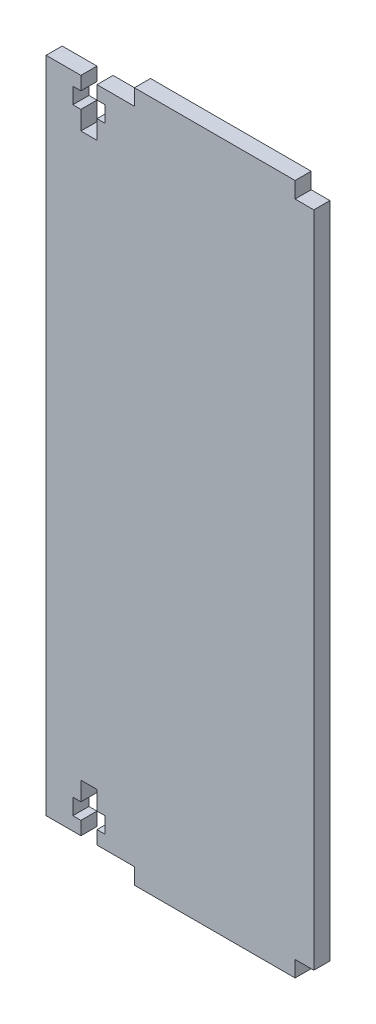
ISO-10303-21;
HEADER;
FILE_DESCRIPTION(('STEP AP214'),'2;1');
FILE_NAME('part.step','',(''),(''),'','','');
FILE_SCHEMA(('AUTOMOTIVE_DESIGN { 1 0 10303 214 1 1 1 1 }'));
ENDSEC;
DATA;
#1=APPLICATION_CONTEXT('core data for automotive mechanical design processes');
#2=APPLICATION_PROTOCOL_DEFINITION('international standard','automotive_design',2000,#1);
#3=PRODUCT_CONTEXT('',#1,'mechanical');
#4=PRODUCT('Part','Part','',(#3));
#5=PRODUCT_RELATED_PRODUCT_CATEGORY('part','',(#4));
#6=PRODUCT_DEFINITION_FORMATION('','',#4);
#7=PRODUCT_DEFINITION_CONTEXT('part definition',#1,'design');
#8=PRODUCT_DEFINITION('design','',#6,#7);
#9=PRODUCT_DEFINITION_SHAPE('','',#8);
#10=(LENGTH_UNIT() NAMED_UNIT(*) SI_UNIT(.MILLI.,.METRE.));
#11=(NAMED_UNIT(*) PLANE_ANGLE_UNIT() SI_UNIT($,.RADIAN.));
#12=(NAMED_UNIT(*) SI_UNIT($,.STERADIAN.) SOLID_ANGLE_UNIT());
#13=UNCERTAINTY_MEASURE_WITH_UNIT(LENGTH_MEASURE(1.E-05),#10,'distance_accuracy_value','');
#14=(GEOMETRIC_REPRESENTATION_CONTEXT(3) GLOBAL_UNCERTAINTY_ASSIGNED_CONTEXT((#13)) GLOBAL_UNIT_ASSIGNED_CONTEXT((#10,
#11,#12)) REPRESENTATION_CONTEXT('',''));
#15=CARTESIAN_POINT('',(0.,0.,0.));
#16=DIRECTION('',(0.,0.,1.));
#17=DIRECTION('',(1.,0.,0.));
#18=AXIS2_PLACEMENT_3D('',#15,#16,#17);
#19=CARTESIAN_POINT('',(21.5,-61.5,3.));
#20=DIRECTION('',(0.,1.,0.));
#21=DIRECTION('',(-1.,0.,0.));
#22=AXIS2_PLACEMENT_3D('',#19,#20,#21);
#23=PLANE('',#22);
#24=DIRECTION('',(1.,0.,0.));
#25=VECTOR('',#24,1.);
#26=CARTESIAN_POINT('',(21.5,-61.5,0.));
#27=LINE('',#26,#25);
#28=CARTESIAN_POINT('',(21.5,-61.5,0.));
#29=VERTEX_POINT('',#28);
#30=CARTESIAN_POINT('',(25.,-61.5,0.));
#31=VERTEX_POINT('',#30);
#32=EDGE_CURVE('E297',#29,#31,#27,.T.);
#33=ORIENTED_EDGE('',*,*,#32,.T.);
#34=DIRECTION('',(0.,0.,-1.));
#35=VECTOR('',#34,1.);
#36=CARTESIAN_POINT('',(25.,-61.5,3.));
#37=LINE('',#36,#35);
#38=CARTESIAN_POINT('',(25.,-61.5,3.));
#39=VERTEX_POINT('',#38);
#40=EDGE_CURVE('E11',#39,#31,#37,.T.);
#41=ORIENTED_EDGE('',*,*,#40,.F.);
#42=DIRECTION('',(1.,0.,0.));
#43=VECTOR('',#42,1.);
#44=CARTESIAN_POINT('',(21.5,-61.5,3.));
#45=LINE('',#44,#43);
#46=CARTESIAN_POINT('',(21.5,-61.5,3.));
#47=VERTEX_POINT('',#46);
#48=EDGE_CURVE('E367',#47,#39,#45,.T.);
#49=ORIENTED_EDGE('',*,*,#48,.F.);
#50=DIRECTION('',(0.,0.,-1.));
#51=VECTOR('',#50,1.);
#52=CARTESIAN_POINT('',(21.5,-61.5,3.));
#53=LINE('',#52,#51);
#54=EDGE_CURVE('E293',#47,#29,#53,.T.);
#55=ORIENTED_EDGE('',*,*,#54,.T.);
#56=EDGE_LOOP('',(#33,#41,#49,#55));
#57=FACE_BOUND('',#56,.T.);
#58=ADVANCED_FACE('F33',(#57),#23,.F.);
#59=CARTESIAN_POINT('',(25.,61.5,3.));
#60=DIRECTION('',(-1.,0.,0.));
#61=DIRECTION('',(0.,-1.,0.));
#62=AXIS2_PLACEMENT_3D('',#59,#60,#61);
#63=PLANE('',#62);
#64=DIRECTION('',(0.,1.,0.));
#65=VECTOR('',#64,1.);
#66=CARTESIAN_POINT('',(25.,61.5,0.));
#67=LINE('',#66,#65);
#68=CARTESIAN_POINT('',(25.,61.5,0.));
#69=VERTEX_POINT('',#68);
#70=EDGE_CURVE('E300',#31,#69,#67,.T.);
#71=ORIENTED_EDGE('',*,*,#70,.T.);
#72=DIRECTION('',(0.,0.,-1.));
#73=VECTOR('',#72,1.);
#74=CARTESIAN_POINT('',(25.,61.5,3.));
#75=LINE('',#74,#73);
#76=CARTESIAN_POINT('',(25.,61.5,3.));
#77=VERTEX_POINT('',#76);
#78=EDGE_CURVE('E41',#77,#69,#75,.T.);
#79=ORIENTED_EDGE('',*,*,#78,.F.);
#80=DIRECTION('',(0.,1.,0.));
#81=VECTOR('',#80,1.);
#82=CARTESIAN_POINT('',(25.,61.5,3.));
#83=LINE('',#82,#81);
#84=EDGE_CURVE('E176',#39,#77,#83,.T.);
#85=ORIENTED_EDGE('',*,*,#84,.F.);
#86=ORIENTED_EDGE('',*,*,#40,.T.);
#87=EDGE_LOOP('',(#71,#79,#85,#86));
#88=FACE_BOUND('',#87,.T.);
#89=ADVANCED_FACE('F565',(#88),#63,.F.);
#90=CARTESIAN_POINT('',(21.5,61.5,3.));
#91=DIRECTION('',(0.,-1.,0.));
#92=DIRECTION('',(1.,0.,0.));
#93=AXIS2_PLACEMENT_3D('',#90,#91,#92);
#94=PLANE('',#93);
#95=DIRECTION('',(-1.,0.,0.));
#96=VECTOR('',#95,1.);
#97=CARTESIAN_POINT('',(21.5,61.5,0.));
#98=LINE('',#97,#96);
#99=CARTESIAN_POINT('',(21.5,61.5,0.));
#100=VERTEX_POINT('',#99);
#101=EDGE_CURVE('E302',#69,#100,#98,.T.);
#102=ORIENTED_EDGE('',*,*,#101,.T.);
#103=DIRECTION('',(0.,0.,-1.));
#104=VECTOR('',#103,1.);
#105=CARTESIAN_POINT('',(21.5,61.5,3.));
#106=LINE('',#105,#104);
#107=CARTESIAN_POINT('',(21.5,61.5,3.));
#108=VERTEX_POINT('',#107);
#109=EDGE_CURVE('E458',#108,#100,#106,.T.);
#110=ORIENTED_EDGE('',*,*,#109,.F.);
#111=DIRECTION('',(-1.,0.,0.));
#112=VECTOR('',#111,1.);
#113=CARTESIAN_POINT('',(21.5,61.5,3.));
#114=LINE('',#113,#112);
#115=EDGE_CURVE('E466',#77,#108,#114,.T.);
#116=ORIENTED_EDGE('',*,*,#115,.F.);
#117=ORIENTED_EDGE('',*,*,#78,.T.);
#118=EDGE_LOOP('',(#102,#110,#116,#117));
#119=FACE_BOUND('',#118,.T.);
#120=ADVANCED_FACE('F464',(#119),#94,.F.);
#121=CARTESIAN_POINT('',(21.5,64.5,3.));
#122=DIRECTION('',(-1.,0.,0.));
#123=DIRECTION('',(0.,0.,1.));
#124=AXIS2_PLACEMENT_3D('',#121,#122,#123);
#125=PLANE('',#124);
#126=DIRECTION('',(0.,1.,0.));
#127=VECTOR('',#126,1.);
#128=CARTESIAN_POINT('',(21.5,64.5,0.));
#129=LINE('',#128,#127);
#130=CARTESIAN_POINT('',(21.5,64.5,0.));
#131=VERTEX_POINT('',#130);
#132=EDGE_CURVE('E304',#100,#131,#129,.T.);
#133=ORIENTED_EDGE('',*,*,#132,.T.);
#134=DIRECTION('',(0.,0.,-1.));
#135=VECTOR('',#134,1.);
#136=CARTESIAN_POINT('',(21.5,64.5,3.));
#137=LINE('',#136,#135);
#138=CARTESIAN_POINT('',(21.5,64.5,3.));
#139=VERTEX_POINT('',#138);
#140=EDGE_CURVE('E455',#139,#131,#137,.T.);
#141=ORIENTED_EDGE('',*,*,#140,.F.);
#142=DIRECTION('',(0.,1.,0.));
#143=VECTOR('',#142,1.);
#144=CARTESIAN_POINT('',(21.5,64.5,3.));
#145=LINE('',#144,#143);
#146=EDGE_CURVE('E484',#108,#139,#145,.T.);
#147=ORIENTED_EDGE('',*,*,#146,.F.);
#148=ORIENTED_EDGE('',*,*,#109,.T.);
#149=EDGE_LOOP('',(#133,#141,#147,#148));
#150=FACE_BOUND('',#149,.T.);
#151=ADVANCED_FACE('F475',(#150),#125,.F.);
#152=CARTESIAN_POINT('',(-8.50000000000002,64.5,3.));
#153=DIRECTION('',(0.,-1.,0.));
#154=DIRECTION('',(0.,0.,-1.));
#155=AXIS2_PLACEMENT_3D('',#152,#153,#154);
#156=PLANE('',#155);
#157=DIRECTION('',(-1.,0.,0.));
#158=VECTOR('',#157,1.);
#159=CARTESIAN_POINT('',(-8.50000000000002,64.5,0.));
#160=LINE('',#159,#158);
#161=CARTESIAN_POINT('',(-8.50000000000002,64.5,0.));
#162=VERTEX_POINT('',#161);
#163=EDGE_CURVE('E306',#131,#162,#160,.T.);
#164=ORIENTED_EDGE('',*,*,#163,.T.);
#165=DIRECTION('',(0.,0.,-1.));
#166=VECTOR('',#165,1.);
#167=CARTESIAN_POINT('',(-8.50000000000002,64.5,3.));
#168=LINE('',#167,#166);
#169=CARTESIAN_POINT('',(-8.50000000000002,64.5,3.));
#170=VERTEX_POINT('',#169);
#171=EDGE_CURVE('E452',#170,#162,#168,.T.);
#172=ORIENTED_EDGE('',*,*,#171,.F.);
#173=DIRECTION('',(-1.,0.,0.));
#174=VECTOR('',#173,1.);
#175=CARTESIAN_POINT('',(-8.50000000000002,64.5,3.));
#176=LINE('',#175,#174);
#177=EDGE_CURVE('E481',#139,#170,#176,.T.);
#178=ORIENTED_EDGE('',*,*,#177,.F.);
#179=ORIENTED_EDGE('',*,*,#140,.T.);
#180=EDGE_LOOP('',(#164,#172,#178,#179));
#181=FACE_BOUND('',#180,.T.);
#182=ADVANCED_FACE('F479',(#181),#156,.F.);
#183=CARTESIAN_POINT('',(-8.50000000000002,64.5,3.));
#184=DIRECTION('',(1.,0.,0.));
#185=DIRECTION('',(0.,0.,-1.));
#186=AXIS2_PLACEMENT_3D('',#183,#184,#185);
#187=PLANE('',#186);
#188=DIRECTION('',(0.,-1.,0.));
#189=VECTOR('',#188,1.);
#190=CARTESIAN_POINT('',(-8.50000000000002,64.5,0.));
#191=LINE('',#190,#189);
#192=CARTESIAN_POINT('',(-8.50000000000002,61.5,0.));
#193=VERTEX_POINT('',#192);
#194=EDGE_CURVE('E308',#162,#193,#191,.T.);
#195=ORIENTED_EDGE('',*,*,#194,.T.);
#196=DIRECTION('',(0.,0.,-1.));
#197=VECTOR('',#196,1.);
#198=CARTESIAN_POINT('',(-8.50000000000002,61.5,3.));
#199=LINE('',#198,#197);
#200=CARTESIAN_POINT('',(-8.50000000000002,61.5,3.));
#201=VERTEX_POINT('',#200);
#202=EDGE_CURVE('E449',#201,#193,#199,.T.);
#203=ORIENTED_EDGE('',*,*,#202,.F.);
#204=DIRECTION('',(0.,-1.,0.));
#205=VECTOR('',#204,1.);
#206=CARTESIAN_POINT('',(-8.50000000000002,64.5,3.));
#207=LINE('',#206,#205);
#208=EDGE_CURVE('E483',#170,#201,#207,.T.);
#209=ORIENTED_EDGE('',*,*,#208,.F.);
#210=ORIENTED_EDGE('',*,*,#171,.T.);
#211=EDGE_LOOP('',(#195,#203,#209,#210));
#212=FACE_BOUND('',#211,.T.);
#213=ADVANCED_FACE('F578',(#212),#187,.F.);
#214=CARTESIAN_POINT('',(-15.5000000000002,61.5,3.));
#215=DIRECTION('',(0.,-1.,0.));
#216=DIRECTION('',(1.,0.,0.));
#217=AXIS2_PLACEMENT_3D('',#214,#215,#216);
#218=PLANE('',#217);
#219=DIRECTION('',(-1.,0.,0.));
#220=VECTOR('',#219,1.);
#221=CARTESIAN_POINT('',(-15.5000000000002,61.5,0.));
#222=LINE('',#221,#220);
#223=CARTESIAN_POINT('',(-15.5000000000002,61.5,0.));
#224=VERTEX_POINT('',#223);
#225=EDGE_CURVE('E310',#193,#224,#222,.T.);
#226=ORIENTED_EDGE('',*,*,#225,.T.);
#227=DIRECTION('',(0.,0.,-1.));
#228=VECTOR('',#227,1.);
#229=CARTESIAN_POINT('',(-15.5000000000002,61.5,3.));
#230=LINE('',#229,#228);
#231=CARTESIAN_POINT('',(-15.5000000000002,61.5,3.));
#232=VERTEX_POINT('',#231);
#233=EDGE_CURVE('E446',#232,#224,#230,.T.);
#234=ORIENTED_EDGE('',*,*,#233,.F.);
#235=DIRECTION('',(-1.,0.,0.));
#236=VECTOR('',#235,1.);
#237=CARTESIAN_POINT('',(-15.5000000000002,61.5,3.));
#238=LINE('',#237,#236);
#239=EDGE_CURVE('E486',#201,#232,#238,.T.);
#240=ORIENTED_EDGE('',*,*,#239,.F.);
#241=ORIENTED_EDGE('',*,*,#202,.T.);
#242=EDGE_LOOP('',(#226,#234,#240,#241));
#243=FACE_BOUND('',#242,.T.);
#244=ADVANCED_FACE('F581',(#243),#218,.F.);
#245=CARTESIAN_POINT('',(-15.5000000000002,59.,3.));
#246=DIRECTION('',(1.,0.,0.));
#247=DIRECTION('',(0.,1.,0.));
#248=AXIS2_PLACEMENT_3D('',#245,#246,#247);
#249=PLANE('',#248);
#250=DIRECTION('',(0.,-1.,0.));
#251=VECTOR('',#250,1.);
#252=CARTESIAN_POINT('',(-15.5000000000002,59.,0.));
#253=LINE('',#252,#251);
#254=CARTESIAN_POINT('',(-15.5000000000002,59.,0.));
#255=VERTEX_POINT('',#254);
#256=EDGE_CURVE('E312',#224,#255,#253,.T.);
#257=ORIENTED_EDGE('',*,*,#256,.T.);
#258=DIRECTION('',(0.,0.,-1.));
#259=VECTOR('',#258,1.);
#260=CARTESIAN_POINT('',(-15.5000000000002,59.,3.));
#261=LINE('',#260,#259);
#262=CARTESIAN_POINT('',(-15.5000000000002,59.,3.));
#263=VERTEX_POINT('',#262);
#264=EDGE_CURVE('E443',#263,#255,#261,.T.);
#265=ORIENTED_EDGE('',*,*,#264,.F.);
#266=DIRECTION('',(0.,-1.,0.));
#267=VECTOR('',#266,1.);
#268=CARTESIAN_POINT('',(-15.5000000000002,59.,3.));
#269=LINE('',#268,#267);
#270=EDGE_CURVE('E492',#232,#263,#269,.T.);
#271=ORIENTED_EDGE('',*,*,#270,.F.);
#272=ORIENTED_EDGE('',*,*,#233,.T.);
#273=EDGE_LOOP('',(#257,#265,#271,#272));
#274=FACE_BOUND('',#273,.T.);
#275=ADVANCED_FACE('F585',(#274),#249,.F.);
#276=CARTESIAN_POINT('',(-15.5000000000002,59.,3.));
#277=DIRECTION('',(0.,1.,0.));
#278=DIRECTION('',(0.,0.,1.));
#279=AXIS2_PLACEMENT_3D('',#276,#277,#278);
#280=PLANE('',#279);
#281=DIRECTION('',(1.,0.,0.));
#282=VECTOR('',#281,1.);
#283=CARTESIAN_POINT('',(-15.5000000000002,59.,0.));
#284=LINE('',#283,#282);
#285=CARTESIAN_POINT('',(-14.0000000000002,59.,0.));
#286=VERTEX_POINT('',#285);
#287=EDGE_CURVE('E314',#255,#286,#284,.T.);
#288=ORIENTED_EDGE('',*,*,#287,.T.);
#289=DIRECTION('',(0.,0.,-1.));
#290=VECTOR('',#289,1.);
#291=CARTESIAN_POINT('',(-14.0000000000002,59.,3.));
#292=LINE('',#291,#290);
#293=CARTESIAN_POINT('',(-14.0000000000002,59.,3.));
#294=VERTEX_POINT('',#293);
#295=EDGE_CURVE('E440',#294,#286,#292,.T.);
#296=ORIENTED_EDGE('',*,*,#295,.F.);
#297=DIRECTION('',(1.,0.,0.));
#298=VECTOR('',#297,1.);
#299=CARTESIAN_POINT('',(-15.5000000000002,59.,3.));
#300=LINE('',#299,#298);
#301=EDGE_CURVE('E494',#263,#294,#300,.T.);
#302=ORIENTED_EDGE('',*,*,#301,.F.);
#303=ORIENTED_EDGE('',*,*,#264,.T.);
#304=EDGE_LOOP('',(#288,#296,#302,#303));
#305=FACE_BOUND('',#304,.T.);
#306=ADVANCED_FACE('F589',(#305),#280,.F.);
#307=CARTESIAN_POINT('',(-14.0000000000002,59.,3.));
#308=DIRECTION('',(1.,0.,0.));
#309=DIRECTION('',(0.,1.,0.));
#310=AXIS2_PLACEMENT_3D('',#307,#308,#309);
#311=PLANE('',#310);
#312=DIRECTION('',(0.,-1.,0.));
#313=VECTOR('',#312,1.);
#314=CARTESIAN_POINT('',(-14.0000000000002,59.,0.));
#315=LINE('',#314,#313);
#316=CARTESIAN_POINT('',(-14.0000000000002,56.,0.));
#317=VERTEX_POINT('',#316);
#318=EDGE_CURVE('E316',#286,#317,#315,.T.);
#319=ORIENTED_EDGE('',*,*,#318,.T.);
#320=DIRECTION('',(0.,0.,-1.));
#321=VECTOR('',#320,1.);
#322=CARTESIAN_POINT('',(-14.0000000000002,56.,3.));
#323=LINE('',#322,#321);
#324=CARTESIAN_POINT('',(-14.0000000000002,56.,3.));
#325=VERTEX_POINT('',#324);
#326=EDGE_CURVE('E437',#325,#317,#323,.T.);
#327=ORIENTED_EDGE('',*,*,#326,.F.);
#328=DIRECTION('',(0.,-1.,0.));
#329=VECTOR('',#328,1.);
#330=CARTESIAN_POINT('',(-14.0000000000002,59.,3.));
#331=LINE('',#330,#329);
#332=EDGE_CURVE('E496',#294,#325,#331,.T.);
#333=ORIENTED_EDGE('',*,*,#332,.F.);
#334=ORIENTED_EDGE('',*,*,#295,.T.);
#335=EDGE_LOOP('',(#319,#327,#333,#334));
#336=FACE_BOUND('',#335,.T.);
#337=ADVANCED_FACE('F593',(#336),#311,.F.);
#338=CARTESIAN_POINT('',(-15.5000000000002,56.,3.));
#339=DIRECTION('',(0.,-1.,0.));
#340=DIRECTION('',(1.,0.,0.));
#341=AXIS2_PLACEMENT_3D('',#338,#339,#340);
#342=PLANE('',#341);
#343=DIRECTION('',(-1.,0.,0.));
#344=VECTOR('',#343,1.);
#345=CARTESIAN_POINT('',(-15.5000000000002,56.,0.));
#346=LINE('',#345,#344);
#347=CARTESIAN_POINT('',(-15.5000000000002,56.,0.));
#348=VERTEX_POINT('',#347);
#349=EDGE_CURVE('E318',#317,#348,#346,.T.);
#350=ORIENTED_EDGE('',*,*,#349,.T.);
#351=DIRECTION('',(0.,0.,-1.));
#352=VECTOR('',#351,1.);
#353=CARTESIAN_POINT('',(-15.5000000000002,56.,3.));
#354=LINE('',#353,#352);
#355=CARTESIAN_POINT('',(-15.5000000000002,56.,3.));
#356=VERTEX_POINT('',#355);
#357=EDGE_CURVE('E434',#356,#348,#354,.T.);
#358=ORIENTED_EDGE('',*,*,#357,.F.);
#359=DIRECTION('',(-1.,0.,0.));
#360=VECTOR('',#359,1.);
#361=CARTESIAN_POINT('',(-15.5000000000002,56.,3.));
#362=LINE('',#361,#360);
#363=EDGE_CURVE('E498',#325,#356,#362,.T.);
#364=ORIENTED_EDGE('',*,*,#363,.F.);
#365=ORIENTED_EDGE('',*,*,#326,.T.);
#366=EDGE_LOOP('',(#350,#358,#364,#365));
#367=FACE_BOUND('',#366,.T.);
#368=ADVANCED_FACE('F597',(#367),#342,.F.);
#369=CARTESIAN_POINT('',(-15.5000000000002,52.5,3.));
#370=DIRECTION('',(1.,0.,0.));
#371=DIRECTION('',(0.,1.,0.));
#372=AXIS2_PLACEMENT_3D('',#369,#370,#371);
#373=PLANE('',#372);
#374=DIRECTION('',(0.,-1.,0.));
#375=VECTOR('',#374,1.);
#376=CARTESIAN_POINT('',(-15.5000000000002,52.5,0.));
#377=LINE('',#376,#375);
#378=CARTESIAN_POINT('',(-15.5000000000002,52.5,0.));
#379=VERTEX_POINT('',#378);
#380=EDGE_CURVE('E320',#348,#379,#377,.T.);
#381=ORIENTED_EDGE('',*,*,#380,.T.);
#382=DIRECTION('',(0.,0.,-1.));
#383=VECTOR('',#382,1.);
#384=CARTESIAN_POINT('',(-15.5000000000002,52.5,3.));
#385=LINE('',#384,#383);
#386=CARTESIAN_POINT('',(-15.5000000000002,52.5,3.));
#387=VERTEX_POINT('',#386);
#388=EDGE_CURVE('E431',#387,#379,#385,.T.);
#389=ORIENTED_EDGE('',*,*,#388,.F.);
#390=DIRECTION('',(0.,-1.,0.));
#391=VECTOR('',#390,1.);
#392=CARTESIAN_POINT('',(-15.5000000000002,52.5,3.));
#393=LINE('',#392,#391);
#394=EDGE_CURVE('E500',#356,#387,#393,.T.);
#395=ORIENTED_EDGE('',*,*,#394,.F.);
#396=ORIENTED_EDGE('',*,*,#357,.T.);
#397=EDGE_LOOP('',(#381,#389,#395,#396));
#398=FACE_BOUND('',#397,.T.);
#399=ADVANCED_FACE('F601',(#398),#373,.F.);
#400=CARTESIAN_POINT('',(-18.5000000000002,52.5,3.));
#401=DIRECTION('',(0.,-1.,0.));
#402=DIRECTION('',(1.,0.,0.));
#403=AXIS2_PLACEMENT_3D('',#400,#401,#402);
#404=PLANE('',#403);
#405=DIRECTION('',(-1.,0.,0.));
#406=VECTOR('',#405,1.);
#407=CARTESIAN_POINT('',(-18.5000000000002,52.5,0.));
#408=LINE('',#407,#406);
#409=CARTESIAN_POINT('',(-18.5000000000002,52.5,0.));
#410=VERTEX_POINT('',#409);
#411=EDGE_CURVE('E322',#379,#410,#408,.T.);
#412=ORIENTED_EDGE('',*,*,#411,.T.);
#413=DIRECTION('',(0.,0.,-1.));
#414=VECTOR('',#413,1.);
#415=CARTESIAN_POINT('',(-18.5000000000002,52.5,3.));
#416=LINE('',#415,#414);
#417=CARTESIAN_POINT('',(-18.5000000000002,52.5,3.));
#418=VERTEX_POINT('',#417);
#419=EDGE_CURVE('E428',#418,#410,#416,.T.);
#420=ORIENTED_EDGE('',*,*,#419,.F.);
#421=DIRECTION('',(-1.,0.,0.));
#422=VECTOR('',#421,1.);
#423=CARTESIAN_POINT('',(-18.5000000000002,52.5,3.));
#424=LINE('',#423,#422);
#425=EDGE_CURVE('E502',#387,#418,#424,.T.);
#426=ORIENTED_EDGE('',*,*,#425,.F.);
#427=ORIENTED_EDGE('',*,*,#388,.T.);
#428=EDGE_LOOP('',(#412,#420,#426,#427));
#429=FACE_BOUND('',#428,.T.);
#430=ADVANCED_FACE('F605',(#429),#404,.F.);
#431=CARTESIAN_POINT('',(-18.5000000000002,52.5,3.));
#432=DIRECTION('',(-1.,0.,0.));
#433=DIRECTION('',(0.,-1.,0.));
#434=AXIS2_PLACEMENT_3D('',#431,#432,#433);
#435=PLANE('',#434);
#436=DIRECTION('',(0.,1.,0.));
#437=VECTOR('',#436,1.);
#438=CARTESIAN_POINT('',(-18.5000000000002,52.5,0.));
#439=LINE('',#438,#437);
#440=CARTESIAN_POINT('',(-18.5000000000002,55.9999999999999,0.));
#441=VERTEX_POINT('',#440);
#442=EDGE_CURVE('E324',#410,#441,#439,.T.);
#443=ORIENTED_EDGE('',*,*,#442,.T.);
#444=DIRECTION('',(0.,0.,-1.));
#445=VECTOR('',#444,1.);
#446=CARTESIAN_POINT('',(-18.5000000000002,55.9999999999999,3.));
#447=LINE('',#446,#445);
#448=CARTESIAN_POINT('',(-18.5000000000002,55.9999999999999,3.));
#449=VERTEX_POINT('',#448);
#450=EDGE_CURVE('E425',#449,#441,#447,.T.);
#451=ORIENTED_EDGE('',*,*,#450,.F.);
#452=DIRECTION('',(0.,1.,0.));
#453=VECTOR('',#452,1.);
#454=CARTESIAN_POINT('',(-18.5000000000002,52.5,3.));
#455=LINE('',#454,#453);
#456=EDGE_CURVE('E504',#418,#449,#455,.T.);
#457=ORIENTED_EDGE('',*,*,#456,.F.);
#458=ORIENTED_EDGE('',*,*,#419,.T.);
#459=EDGE_LOOP('',(#443,#451,#457,#458));
#460=FACE_BOUND('',#459,.T.);
#461=ADVANCED_FACE('F609',(#460),#435,.F.);
#462=CARTESIAN_POINT('',(-20.0000000000002,55.9999999999999,3.));
#463=DIRECTION('',(0.,-1.,0.));
#464=DIRECTION('',(0.,0.,-1.));
#465=AXIS2_PLACEMENT_3D('',#462,#463,#464);
#466=PLANE('',#465);
#467=DIRECTION('',(-1.,0.,0.));
#468=VECTOR('',#467,1.);
#469=CARTESIAN_POINT('',(-20.0000000000002,55.9999999999999,0.));
#470=LINE('',#469,#468);
#471=CARTESIAN_POINT('',(-20.0000000000002,55.9999999999999,0.));
#472=VERTEX_POINT('',#471);
#473=EDGE_CURVE('E326',#441,#472,#470,.T.);
#474=ORIENTED_EDGE('',*,*,#473,.T.);
#475=DIRECTION('',(0.,0.,-1.));
#476=VECTOR('',#475,1.);
#477=CARTESIAN_POINT('',(-20.0000000000002,55.9999999999999,3.));
#478=LINE('',#477,#476);
#479=CARTESIAN_POINT('',(-20.0000000000002,55.9999999999999,3.));
#480=VERTEX_POINT('',#479);
#481=EDGE_CURVE('E422',#480,#472,#478,.T.);
#482=ORIENTED_EDGE('',*,*,#481,.F.);
#483=DIRECTION('',(-1.,0.,0.));
#484=VECTOR('',#483,1.);
#485=CARTESIAN_POINT('',(-20.0000000000002,55.9999999999999,3.));
#486=LINE('',#485,#484);
#487=EDGE_CURVE('E506',#449,#480,#486,.T.);
#488=ORIENTED_EDGE('',*,*,#487,.F.);
#489=ORIENTED_EDGE('',*,*,#450,.T.);
#490=EDGE_LOOP('',(#474,#482,#488,#489));
#491=FACE_BOUND('',#490,.T.);
#492=ADVANCED_FACE('F613',(#491),#466,.F.);
#493=CARTESIAN_POINT('',(-20.0000000000002,59.,3.));
#494=DIRECTION('',(-1.,0.,0.));
#495=DIRECTION('',(0.,-1.,0.));
#496=AXIS2_PLACEMENT_3D('',#493,#494,#495);
#497=PLANE('',#496);
#498=DIRECTION('',(0.,1.,0.));
#499=VECTOR('',#498,1.);
#500=CARTESIAN_POINT('',(-20.0000000000002,59.,0.));
#501=LINE('',#500,#499);
#502=CARTESIAN_POINT('',(-20.0000000000002,59.,0.));
#503=VERTEX_POINT('',#502);
#504=EDGE_CURVE('E328',#472,#503,#501,.T.);
#505=ORIENTED_EDGE('',*,*,#504,.T.);
#506=DIRECTION('',(0.,0.,-1.));
#507=VECTOR('',#506,1.);
#508=CARTESIAN_POINT('',(-20.0000000000002,59.,3.));
#509=LINE('',#508,#507);
#510=CARTESIAN_POINT('',(-20.0000000000002,59.,3.));
#511=VERTEX_POINT('',#510);
#512=EDGE_CURVE('E419',#511,#503,#509,.T.);
#513=ORIENTED_EDGE('',*,*,#512,.F.);
#514=DIRECTION('',(0.,1.,0.));
#515=VECTOR('',#514,1.);
#516=CARTESIAN_POINT('',(-20.0000000000002,59.,3.));
#517=LINE('',#516,#515);
#518=EDGE_CURVE('E508',#480,#511,#517,.T.);
#519=ORIENTED_EDGE('',*,*,#518,.F.);
#520=ORIENTED_EDGE('',*,*,#481,.T.);
#521=EDGE_LOOP('',(#505,#513,#519,#520));
#522=FACE_BOUND('',#521,.T.);
#523=ADVANCED_FACE('F617',(#522),#497,.F.);
#524=CARTESIAN_POINT('',(-20.0000000000002,59.,3.));
#525=DIRECTION('',(0.,1.,0.));
#526=DIRECTION('',(-1.,0.,0.));
#527=AXIS2_PLACEMENT_3D('',#524,#525,#526);
#528=PLANE('',#527);
#529=DIRECTION('',(1.,0.,0.));
#530=VECTOR('',#529,1.);
#531=CARTESIAN_POINT('',(-20.0000000000002,59.,0.));
#532=LINE('',#531,#530);
#533=CARTESIAN_POINT('',(-18.5000000000002,59.,0.));
#534=VERTEX_POINT('',#533);
#535=EDGE_CURVE('E330',#503,#534,#532,.T.);
#536=ORIENTED_EDGE('',*,*,#535,.T.);
#537=DIRECTION('',(0.,0.,-1.));
#538=VECTOR('',#537,1.);
#539=CARTESIAN_POINT('',(-18.5000000000002,59.,3.));
#540=LINE('',#539,#538);
#541=CARTESIAN_POINT('',(-18.5000000000002,59.,3.));
#542=VERTEX_POINT('',#541);
#543=EDGE_CURVE('E416',#542,#534,#540,.T.);
#544=ORIENTED_EDGE('',*,*,#543,.F.);
#545=DIRECTION('',(1.,0.,0.));
#546=VECTOR('',#545,1.);
#547=CARTESIAN_POINT('',(-20.0000000000002,59.,3.));
#548=LINE('',#547,#546);
#549=EDGE_CURVE('E510',#511,#542,#548,.T.);
#550=ORIENTED_EDGE('',*,*,#549,.F.);
#551=ORIENTED_EDGE('',*,*,#512,.T.);
#552=EDGE_LOOP('',(#536,#544,#550,#551));
#553=FACE_BOUND('',#552,.T.);
#554=ADVANCED_FACE('F621',(#553),#528,.F.);
#555=CARTESIAN_POINT('',(-18.5000000000002,59.,3.));
#556=DIRECTION('',(-1.,0.,0.));
#557=DIRECTION('',(0.,-1.,0.));
#558=AXIS2_PLACEMENT_3D('',#555,#556,#557);
#559=PLANE('',#558);
#560=DIRECTION('',(0.,1.,0.));
#561=VECTOR('',#560,1.);
#562=CARTESIAN_POINT('',(-18.5000000000002,59.,0.));
#563=LINE('',#562,#561);
#564=CARTESIAN_POINT('',(-18.5000000000002,61.5,0.));
#565=VERTEX_POINT('',#564);
#566=EDGE_CURVE('E332',#534,#565,#563,.T.);
#567=ORIENTED_EDGE('',*,*,#566,.T.);
#568=DIRECTION('',(0.,0.,-1.));
#569=VECTOR('',#568,1.);
#570=CARTESIAN_POINT('',(-18.5000000000002,61.5,3.));
#571=LINE('',#570,#569);
#572=CARTESIAN_POINT('',(-18.5000000000002,61.5,3.));
#573=VERTEX_POINT('',#572);
#574=EDGE_CURVE('E413',#573,#565,#571,.T.);
#575=ORIENTED_EDGE('',*,*,#574,.F.);
#576=DIRECTION('',(0.,1.,0.));
#577=VECTOR('',#576,1.);
#578=CARTESIAN_POINT('',(-18.5000000000002,59.,3.));
#579=LINE('',#578,#577);
#580=EDGE_CURVE('E512',#542,#573,#579,.T.);
#581=ORIENTED_EDGE('',*,*,#580,.F.);
#582=ORIENTED_EDGE('',*,*,#543,.T.);
#583=EDGE_LOOP('',(#567,#575,#581,#582));
#584=FACE_BOUND('',#583,.T.);
#585=ADVANCED_FACE('F625',(#584),#559,.F.);
#586=CARTESIAN_POINT('',(-25.,61.5,3.));
#587=DIRECTION('',(0.,-1.,0.));
#588=DIRECTION('',(1.,0.,0.));
#589=AXIS2_PLACEMENT_3D('',#586,#587,#588);
#590=PLANE('',#589);
#591=DIRECTION('',(-1.,0.,0.));
#592=VECTOR('',#591,1.);
#593=CARTESIAN_POINT('',(-25.,61.5,0.));
#594=LINE('',#593,#592);
#595=CARTESIAN_POINT('',(-25.,61.5,0.));
#596=VERTEX_POINT('',#595);
#597=EDGE_CURVE('E334',#565,#596,#594,.T.);
#598=ORIENTED_EDGE('',*,*,#597,.T.);
#599=DIRECTION('',(0.,0.,-1.));
#600=VECTOR('',#599,1.);
#601=CARTESIAN_POINT('',(-25.,61.5,3.));
#602=LINE('',#601,#600);
#603=CARTESIAN_POINT('',(-25.,61.5,3.));
#604=VERTEX_POINT('',#603);
#605=EDGE_CURVE('E410',#604,#596,#602,.T.);
#606=ORIENTED_EDGE('',*,*,#605,.F.);
#607=DIRECTION('',(-1.,0.,0.));
#608=VECTOR('',#607,1.);
#609=CARTESIAN_POINT('',(-25.,61.5,3.));
#610=LINE('',#609,#608);
#611=EDGE_CURVE('E514',#573,#604,#610,.T.);
#612=ORIENTED_EDGE('',*,*,#611,.F.);
#613=ORIENTED_EDGE('',*,*,#574,.T.);
#614=EDGE_LOOP('',(#598,#606,#612,#613));
#615=FACE_BOUND('',#614,.T.);
#616=ADVANCED_FACE('F629',(#615),#590,.F.);
#617=CARTESIAN_POINT('',(-25.,61.5,3.));
#618=DIRECTION('',(1.,0.,0.));
#619=DIRECTION('',(0.,1.,0.));
#620=AXIS2_PLACEMENT_3D('',#617,#618,#619);
#621=PLANE('',#620);
#622=DIRECTION('',(0.,-1.,0.));
#623=VECTOR('',#622,1.);
#624=CARTESIAN_POINT('',(-25.,61.5,0.));
#625=LINE('',#624,#623);
#626=CARTESIAN_POINT('',(-25.,-61.5,0.));
#627=VERTEX_POINT('',#626);
#628=EDGE_CURVE('E336',#596,#627,#625,.T.);
#629=ORIENTED_EDGE('',*,*,#628,.T.);
#630=DIRECTION('',(0.,0.,-1.));
#631=VECTOR('',#630,1.);
#632=CARTESIAN_POINT('',(-25.,-61.5,3.));
#633=LINE('',#632,#631);
#634=CARTESIAN_POINT('',(-25.,-61.5,3.));
#635=VERTEX_POINT('',#634);
#636=EDGE_CURVE('E407',#635,#627,#633,.T.);
#637=ORIENTED_EDGE('',*,*,#636,.F.);
#638=DIRECTION('',(0.,-1.,0.));
#639=VECTOR('',#638,1.);
#640=CARTESIAN_POINT('',(-25.,61.5,3.));
#641=LINE('',#640,#639);
#642=EDGE_CURVE('E516',#604,#635,#641,.T.);
#643=ORIENTED_EDGE('',*,*,#642,.F.);
#644=ORIENTED_EDGE('',*,*,#605,.T.);
#645=EDGE_LOOP('',(#629,#637,#643,#644));
#646=FACE_BOUND('',#645,.T.);
#647=ADVANCED_FACE('F633',(#646),#621,.F.);
#648=CARTESIAN_POINT('',(-25.,-61.5,3.));
#649=DIRECTION('',(0.,1.,0.));
#650=DIRECTION('',(-1.,0.,0.));
#651=AXIS2_PLACEMENT_3D('',#648,#649,#650);
#652=PLANE('',#651);
#653=DIRECTION('',(1.,0.,0.));
#654=VECTOR('',#653,1.);
#655=CARTESIAN_POINT('',(-25.,-61.5,0.));
#656=LINE('',#655,#654);
#657=CARTESIAN_POINT('',(-18.5,-61.5,0.));
#658=VERTEX_POINT('',#657);
#659=EDGE_CURVE('E338',#627,#658,#656,.T.);
#660=ORIENTED_EDGE('',*,*,#659,.T.);
#661=DIRECTION('',(0.,0.,-1.));
#662=VECTOR('',#661,1.);
#663=CARTESIAN_POINT('',(-18.5,-61.5,3.));
#664=LINE('',#663,#662);
#665=CARTESIAN_POINT('',(-18.5,-61.5,3.));
#666=VERTEX_POINT('',#665);
#667=EDGE_CURVE('E404',#666,#658,#664,.T.);
#668=ORIENTED_EDGE('',*,*,#667,.F.);
#669=DIRECTION('',(1.,0.,0.));
#670=VECTOR('',#669,1.);
#671=CARTESIAN_POINT('',(-25.,-61.5,3.));
#672=LINE('',#671,#670);
#673=EDGE_CURVE('E518',#635,#666,#672,.T.);
#674=ORIENTED_EDGE('',*,*,#673,.F.);
#675=ORIENTED_EDGE('',*,*,#636,.T.);
#676=EDGE_LOOP('',(#660,#668,#674,#675));
#677=FACE_BOUND('',#676,.T.);
#678=ADVANCED_FACE('F637',(#677),#652,.F.);
#679=CARTESIAN_POINT('',(-18.5,-59.,3.));
#680=DIRECTION('',(-1.,0.,0.));
#681=DIRECTION('',(0.,0.,1.));
#682=AXIS2_PLACEMENT_3D('',#679,#680,#681);
#683=PLANE('',#682);
#684=DIRECTION('',(0.,1.,0.));
#685=VECTOR('',#684,1.);
#686=CARTESIAN_POINT('',(-18.5,-59.,0.));
#687=LINE('',#686,#685);
#688=CARTESIAN_POINT('',(-18.5,-59.,0.));
#689=VERTEX_POINT('',#688);
#690=EDGE_CURVE('E340',#658,#689,#687,.T.);
#691=ORIENTED_EDGE('',*,*,#690,.T.);
#692=DIRECTION('',(0.,0.,-1.));
#693=VECTOR('',#692,1.);
#694=CARTESIAN_POINT('',(-18.5,-59.,3.));
#695=LINE('',#694,#693);
#696=CARTESIAN_POINT('',(-18.5,-59.,3.));
#697=VERTEX_POINT('',#696);
#698=EDGE_CURVE('E401',#697,#689,#695,.T.);
#699=ORIENTED_EDGE('',*,*,#698,.F.);
#700=DIRECTION('',(0.,1.,0.));
#701=VECTOR('',#700,1.);
#702=CARTESIAN_POINT('',(-18.5,-59.,3.));
#703=LINE('',#702,#701);
#704=EDGE_CURVE('E520',#666,#697,#703,.T.);
#705=ORIENTED_EDGE('',*,*,#704,.F.);
#706=ORIENTED_EDGE('',*,*,#667,.T.);
#707=EDGE_LOOP('',(#691,#699,#705,#706));
#708=FACE_BOUND('',#707,.T.);
#709=ADVANCED_FACE('F641',(#708),#683,.F.);
#710=CARTESIAN_POINT('',(-20.,-59.,3.));
#711=DIRECTION('',(0.,-1.,0.));
#712=DIRECTION('',(0.,0.,-1.));
#713=AXIS2_PLACEMENT_3D('',#710,#711,#712);
#714=PLANE('',#713);
#715=DIRECTION('',(-1.,0.,0.));
#716=VECTOR('',#715,1.);
#717=CARTESIAN_POINT('',(-20.,-59.,0.));
#718=LINE('',#717,#716);
#719=CARTESIAN_POINT('',(-20.,-59.,0.));
#720=VERTEX_POINT('',#719);
#721=EDGE_CURVE('E342',#689,#720,#718,.T.);
#722=ORIENTED_EDGE('',*,*,#721,.T.);
#723=DIRECTION('',(0.,0.,-1.));
#724=VECTOR('',#723,1.);
#725=CARTESIAN_POINT('',(-20.,-59.,3.));
#726=LINE('',#725,#724);
#727=CARTESIAN_POINT('',(-20.,-59.,3.));
#728=VERTEX_POINT('',#727);
#729=EDGE_CURVE('E398',#728,#720,#726,.T.);
#730=ORIENTED_EDGE('',*,*,#729,.F.);
#731=DIRECTION('',(-1.,0.,0.));
#732=VECTOR('',#731,1.);
#733=CARTESIAN_POINT('',(-20.,-59.,3.));
#734=LINE('',#733,#732);
#735=EDGE_CURVE('E522',#697,#728,#734,.T.);
#736=ORIENTED_EDGE('',*,*,#735,.F.);
#737=ORIENTED_EDGE('',*,*,#698,.T.);
#738=EDGE_LOOP('',(#722,#730,#736,#737));
#739=FACE_BOUND('',#738,.T.);
#740=ADVANCED_FACE('F645',(#739),#714,.F.);
#741=CARTESIAN_POINT('',(-20.,-59.,3.));
#742=DIRECTION('',(-1.,0.,0.));
#743=DIRECTION('',(0.,0.,1.));
#744=AXIS2_PLACEMENT_3D('',#741,#742,#743);
#745=PLANE('',#744);
#746=DIRECTION('',(0.,1.,0.));
#747=VECTOR('',#746,1.);
#748=CARTESIAN_POINT('',(-20.,-59.,0.));
#749=LINE('',#748,#747);
#750=CARTESIAN_POINT('',(-20.,-56.,0.));
#751=VERTEX_POINT('',#750);
#752=EDGE_CURVE('E344',#720,#751,#749,.T.);
#753=ORIENTED_EDGE('',*,*,#752,.T.);
#754=DIRECTION('',(0.,0.,-1.));
#755=VECTOR('',#754,1.);
#756=CARTESIAN_POINT('',(-20.,-56.,3.));
#757=LINE('',#756,#755);
#758=CARTESIAN_POINT('',(-20.,-56.,3.));
#759=VERTEX_POINT('',#758);
#760=EDGE_CURVE('E395',#759,#751,#757,.T.);
#761=ORIENTED_EDGE('',*,*,#760,.F.);
#762=DIRECTION('',(0.,1.,0.));
#763=VECTOR('',#762,1.);
#764=CARTESIAN_POINT('',(-20.,-59.,3.));
#765=LINE('',#764,#763);
#766=EDGE_CURVE('E524',#728,#759,#765,.T.);
#767=ORIENTED_EDGE('',*,*,#766,.F.);
#768=ORIENTED_EDGE('',*,*,#729,.T.);
#769=EDGE_LOOP('',(#753,#761,#767,#768));
#770=FACE_BOUND('',#769,.T.);
#771=ADVANCED_FACE('F649',(#770),#745,.F.);
#772=CARTESIAN_POINT('',(-20.,-56.,3.));
#773=DIRECTION('',(0.,1.,0.));
#774=DIRECTION('',(0.,0.,1.));
#775=AXIS2_PLACEMENT_3D('',#772,#773,#774);
#776=PLANE('',#775);
#777=DIRECTION('',(1.,0.,0.));
#778=VECTOR('',#777,1.);
#779=CARTESIAN_POINT('',(-20.,-56.,0.));
#780=LINE('',#779,#778);
#781=CARTESIAN_POINT('',(-18.5,-56.,0.));
#782=VERTEX_POINT('',#781);
#783=EDGE_CURVE('E346',#751,#782,#780,.T.);
#784=ORIENTED_EDGE('',*,*,#783,.T.);
#785=DIRECTION('',(0.,0.,-1.));
#786=VECTOR('',#785,1.);
#787=CARTESIAN_POINT('',(-18.5,-56.,3.));
#788=LINE('',#787,#786);
#789=CARTESIAN_POINT('',(-18.5,-56.,3.));
#790=VERTEX_POINT('',#789);
#791=EDGE_CURVE('E392',#790,#782,#788,.T.);
#792=ORIENTED_EDGE('',*,*,#791,.F.);
#793=DIRECTION('',(1.,0.,0.));
#794=VECTOR('',#793,1.);
#795=CARTESIAN_POINT('',(-20.,-56.,3.));
#796=LINE('',#795,#794);
#797=EDGE_CURVE('E526',#759,#790,#796,.T.);
#798=ORIENTED_EDGE('',*,*,#797,.F.);
#799=ORIENTED_EDGE('',*,*,#760,.T.);
#800=EDGE_LOOP('',(#784,#792,#798,#799));
#801=FACE_BOUND('',#800,.T.);
#802=ADVANCED_FACE('F653',(#801),#776,.F.);
#803=CARTESIAN_POINT('',(-18.5,-52.5,3.));
#804=DIRECTION('',(-1.,0.,0.));
#805=DIRECTION('',(0.,0.,1.));
#806=AXIS2_PLACEMENT_3D('',#803,#804,#805);
#807=PLANE('',#806);
#808=DIRECTION('',(0.,1.,0.));
#809=VECTOR('',#808,1.);
#810=CARTESIAN_POINT('',(-18.5,-52.5,0.));
#811=LINE('',#810,#809);
#812=CARTESIAN_POINT('',(-18.5,-52.5,0.));
#813=VERTEX_POINT('',#812);
#814=EDGE_CURVE('E348',#782,#813,#811,.T.);
#815=ORIENTED_EDGE('',*,*,#814,.T.);
#816=DIRECTION('',(0.,0.,-1.));
#817=VECTOR('',#816,1.);
#818=CARTESIAN_POINT('',(-18.5,-52.5,3.));
#819=LINE('',#818,#817);
#820=CARTESIAN_POINT('',(-18.5,-52.5,3.));
#821=VERTEX_POINT('',#820);
#822=EDGE_CURVE('E389',#821,#813,#819,.T.);
#823=ORIENTED_EDGE('',*,*,#822,.F.);
#824=DIRECTION('',(0.,1.,0.));
#825=VECTOR('',#824,1.);
#826=CARTESIAN_POINT('',(-18.5,-52.5,3.));
#827=LINE('',#826,#825);
#828=EDGE_CURVE('E528',#790,#821,#827,.T.);
#829=ORIENTED_EDGE('',*,*,#828,.F.);
#830=ORIENTED_EDGE('',*,*,#791,.T.);
#831=EDGE_LOOP('',(#815,#823,#829,#830));
#832=FACE_BOUND('',#831,.T.);
#833=ADVANCED_FACE('F657',(#832),#807,.F.);
#834=CARTESIAN_POINT('',(-18.5,-52.5,3.));
#835=DIRECTION('',(0.,1.,0.));
#836=DIRECTION('',(0.,0.,1.));
#837=AXIS2_PLACEMENT_3D('',#834,#835,#836);
#838=PLANE('',#837);
#839=DIRECTION('',(1.,0.,0.));
#840=VECTOR('',#839,1.);
#841=CARTESIAN_POINT('',(-18.5,-52.5,0.));
#842=LINE('',#841,#840);
#843=CARTESIAN_POINT('',(-15.5,-52.5,0.));
#844=VERTEX_POINT('',#843);
#845=EDGE_CURVE('E350',#813,#844,#842,.T.);
#846=ORIENTED_EDGE('',*,*,#845,.T.);
#847=DIRECTION('',(0.,0.,-1.));
#848=VECTOR('',#847,1.);
#849=CARTESIAN_POINT('',(-15.5,-52.5,3.));
#850=LINE('',#849,#848);
#851=CARTESIAN_POINT('',(-15.5,-52.5,3.));
#852=VERTEX_POINT('',#851);
#853=EDGE_CURVE('E386',#852,#844,#850,.T.);
#854=ORIENTED_EDGE('',*,*,#853,.F.);
#855=DIRECTION('',(1.,0.,0.));
#856=VECTOR('',#855,1.);
#857=CARTESIAN_POINT('',(-18.5,-52.5,3.));
#858=LINE('',#857,#856);
#859=EDGE_CURVE('E530',#821,#852,#858,.T.);
#860=ORIENTED_EDGE('',*,*,#859,.F.);
#861=ORIENTED_EDGE('',*,*,#822,.T.);
#862=EDGE_LOOP('',(#846,#854,#860,#861));
#863=FACE_BOUND('',#862,.T.);
#864=ADVANCED_FACE('F661',(#863),#838,.F.);
#865=CARTESIAN_POINT('',(-15.5,-52.5,3.));
#866=DIRECTION('',(1.,0.,0.));
#867=DIRECTION('',(0.,0.,-1.));
#868=AXIS2_PLACEMENT_3D('',#865,#866,#867);
#869=PLANE('',#868);
#870=DIRECTION('',(0.,-1.,0.));
#871=VECTOR('',#870,1.);
#872=CARTESIAN_POINT('',(-15.5,-52.5,0.));
#873=LINE('',#872,#871);
#874=CARTESIAN_POINT('',(-15.5,-56.,0.));
#875=VERTEX_POINT('',#874);
#876=EDGE_CURVE('E352',#844,#875,#873,.T.);
#877=ORIENTED_EDGE('',*,*,#876,.T.);
#878=DIRECTION('',(0.,0.,-1.));
#879=VECTOR('',#878,1.);
#880=CARTESIAN_POINT('',(-15.5,-56.,3.));
#881=LINE('',#880,#879);
#882=CARTESIAN_POINT('',(-15.5,-56.,3.));
#883=VERTEX_POINT('',#882);
#884=EDGE_CURVE('E383',#883,#875,#881,.T.);
#885=ORIENTED_EDGE('',*,*,#884,.F.);
#886=DIRECTION('',(0.,-1.,0.));
#887=VECTOR('',#886,1.);
#888=CARTESIAN_POINT('',(-15.5,-52.5,3.));
#889=LINE('',#888,#887);
#890=EDGE_CURVE('E532',#852,#883,#889,.T.);
#891=ORIENTED_EDGE('',*,*,#890,.F.);
#892=ORIENTED_EDGE('',*,*,#853,.T.);
#893=EDGE_LOOP('',(#877,#885,#891,#892));
#894=FACE_BOUND('',#893,.T.);
#895=ADVANCED_FACE('F665',(#894),#869,.F.);
#896=CARTESIAN_POINT('',(-15.5,-56.,3.));
#897=DIRECTION('',(0.,1.,0.));
#898=DIRECTION('',(0.,0.,1.));
#899=AXIS2_PLACEMENT_3D('',#896,#897,#898);
#900=PLANE('',#899);
#901=DIRECTION('',(1.,0.,0.));
#902=VECTOR('',#901,1.);
#903=CARTESIAN_POINT('',(-15.5,-56.,0.));
#904=LINE('',#903,#902);
#905=CARTESIAN_POINT('',(-14.,-56.,0.));
#906=VERTEX_POINT('',#905);
#907=EDGE_CURVE('E354',#875,#906,#904,.T.);
#908=ORIENTED_EDGE('',*,*,#907,.T.);
#909=DIRECTION('',(0.,0.,-1.));
#910=VECTOR('',#909,1.);
#911=CARTESIAN_POINT('',(-14.,-56.,3.));
#912=LINE('',#911,#910);
#913=CARTESIAN_POINT('',(-14.,-56.,3.));
#914=VERTEX_POINT('',#913);
#915=EDGE_CURVE('E380',#914,#906,#912,.T.);
#916=ORIENTED_EDGE('',*,*,#915,.F.);
#917=DIRECTION('',(1.,0.,0.));
#918=VECTOR('',#917,1.);
#919=CARTESIAN_POINT('',(-15.5,-56.,3.));
#920=LINE('',#919,#918);
#921=EDGE_CURVE('E534',#883,#914,#920,.T.);
#922=ORIENTED_EDGE('',*,*,#921,.F.);
#923=ORIENTED_EDGE('',*,*,#884,.T.);
#924=EDGE_LOOP('',(#908,#916,#922,#923));
#925=FACE_BOUND('',#924,.T.);
#926=ADVANCED_FACE('F669',(#925),#900,.F.);
#927=CARTESIAN_POINT('',(-14.,-59.,3.));
#928=DIRECTION('',(1.,0.,0.));
#929=DIRECTION('',(0.,0.,-1.));
#930=AXIS2_PLACEMENT_3D('',#927,#928,#929);
#931=PLANE('',#930);
#932=DIRECTION('',(0.,-1.,0.));
#933=VECTOR('',#932,1.);
#934=CARTESIAN_POINT('',(-14.,-59.,0.));
#935=LINE('',#934,#933);
#936=CARTESIAN_POINT('',(-14.,-59.,0.));
#937=VERTEX_POINT('',#936);
#938=EDGE_CURVE('E356',#906,#937,#935,.T.);
#939=ORIENTED_EDGE('',*,*,#938,.T.);
#940=DIRECTION('',(0.,0.,-1.));
#941=VECTOR('',#940,1.);
#942=CARTESIAN_POINT('',(-14.,-59.,3.));
#943=LINE('',#942,#941);
#944=CARTESIAN_POINT('',(-14.,-59.,3.));
#945=VERTEX_POINT('',#944);
#946=EDGE_CURVE('E377',#945,#937,#943,.T.);
#947=ORIENTED_EDGE('',*,*,#946,.F.);
#948=DIRECTION('',(0.,-1.,0.));
#949=VECTOR('',#948,1.);
#950=CARTESIAN_POINT('',(-14.,-59.,3.));
#951=LINE('',#950,#949);
#952=EDGE_CURVE('E536',#914,#945,#951,.T.);
#953=ORIENTED_EDGE('',*,*,#952,.F.);
#954=ORIENTED_EDGE('',*,*,#915,.T.);
#955=EDGE_LOOP('',(#939,#947,#953,#954));
#956=FACE_BOUND('',#955,.T.);
#957=ADVANCED_FACE('F673',(#956),#931,.F.);
#958=CARTESIAN_POINT('',(-15.5,-59.,3.));
#959=DIRECTION('',(0.,-1.,0.));
#960=DIRECTION('',(0.,0.,-1.));
#961=AXIS2_PLACEMENT_3D('',#958,#959,#960);
#962=PLANE('',#961);
#963=DIRECTION('',(-1.,0.,0.));
#964=VECTOR('',#963,1.);
#965=CARTESIAN_POINT('',(-15.5,-59.,0.));
#966=LINE('',#965,#964);
#967=CARTESIAN_POINT('',(-15.5,-59.,0.));
#968=VERTEX_POINT('',#967);
#969=EDGE_CURVE('E358',#937,#968,#966,.T.);
#970=ORIENTED_EDGE('',*,*,#969,.T.);
#971=DIRECTION('',(0.,0.,-1.));
#972=VECTOR('',#971,1.);
#973=CARTESIAN_POINT('',(-15.5,-59.,3.));
#974=LINE('',#973,#972);
#975=CARTESIAN_POINT('',(-15.5,-59.,3.));
#976=VERTEX_POINT('',#975);
#977=EDGE_CURVE('E374',#976,#968,#974,.T.);
#978=ORIENTED_EDGE('',*,*,#977,.F.);
#979=DIRECTION('',(-1.,0.,0.));
#980=VECTOR('',#979,1.);
#981=CARTESIAN_POINT('',(-15.5,-59.,3.));
#982=LINE('',#981,#980);
#983=EDGE_CURVE('E538',#945,#976,#982,.T.);
#984=ORIENTED_EDGE('',*,*,#983,.F.);
#985=ORIENTED_EDGE('',*,*,#946,.T.);
#986=EDGE_LOOP('',(#970,#978,#984,#985));
#987=FACE_BOUND('',#986,.T.);
#988=ADVANCED_FACE('F677',(#987),#962,.F.);
#989=CARTESIAN_POINT('',(-15.5,-59.,3.));
#990=DIRECTION('',(1.,0.,0.));
#991=DIRECTION('',(0.,0.,-1.));
#992=AXIS2_PLACEMENT_3D('',#989,#990,#991);
#993=PLANE('',#992);
#994=DIRECTION('',(0.,-1.,0.));
#995=VECTOR('',#994,1.);
#996=CARTESIAN_POINT('',(-15.5,-59.,0.));
#997=LINE('',#996,#995);
#998=CARTESIAN_POINT('',(-15.5,-61.5,0.));
#999=VERTEX_POINT('',#998);
#1000=EDGE_CURVE('E360',#968,#999,#997,.T.);
#1001=ORIENTED_EDGE('',*,*,#1000,.T.);
#1002=DIRECTION('',(0.,0.,-1.));
#1003=VECTOR('',#1002,1.);
#1004=CARTESIAN_POINT('',(-15.5,-61.5,3.));
#1005=LINE('',#1004,#1003);
#1006=CARTESIAN_POINT('',(-15.5,-61.5,3.));
#1007=VERTEX_POINT('',#1006);
#1008=EDGE_CURVE('E371',#1007,#999,#1005,.T.);
#1009=ORIENTED_EDGE('',*,*,#1008,.F.);
#1010=DIRECTION('',(0.,-1.,0.));
#1011=VECTOR('',#1010,1.);
#1012=CARTESIAN_POINT('',(-15.5,-59.,3.));
#1013=LINE('',#1012,#1011);
#1014=EDGE_CURVE('E540',#976,#1007,#1013,.T.);
#1015=ORIENTED_EDGE('',*,*,#1014,.F.);
#1016=ORIENTED_EDGE('',*,*,#977,.T.);
#1017=EDGE_LOOP('',(#1001,#1009,#1015,#1016));
#1018=FACE_BOUND('',#1017,.T.);
#1019=ADVANCED_FACE('F546',(#1018),#993,.F.);
#1020=CARTESIAN_POINT('',(-15.5,-61.5,3.));
#1021=DIRECTION('',(0.,1.,0.));
#1022=DIRECTION('',(-1.,0.,0.));
#1023=AXIS2_PLACEMENT_3D('',#1020,#1021,#1022);
#1024=PLANE('',#1023);
#1025=DIRECTION('',(1.,0.,0.));
#1026=VECTOR('',#1025,1.);
#1027=CARTESIAN_POINT('',(-15.5,-61.5,0.));
#1028=LINE('',#1027,#1026);
#1029=CARTESIAN_POINT('',(-8.5,-61.5,0.));
#1030=VERTEX_POINT('',#1029);
#1031=EDGE_CURVE('E362',#999,#1030,#1028,.T.);
#1032=ORIENTED_EDGE('',*,*,#1031,.T.);
#1033=DIRECTION('',(0.,0.,-1.));
#1034=VECTOR('',#1033,1.);
#1035=CARTESIAN_POINT('',(-8.5,-61.5,3.));
#1036=LINE('',#1035,#1034);
#1037=CARTESIAN_POINT('',(-8.5,-61.5,3.));
#1038=VERTEX_POINT('',#1037);
#1039=EDGE_CURVE('E288',#1038,#1030,#1036,.T.);
#1040=ORIENTED_EDGE('',*,*,#1039,.F.);
#1041=DIRECTION('',(1.,0.,0.));
#1042=VECTOR('',#1041,1.);
#1043=CARTESIAN_POINT('',(-15.5,-61.5,3.));
#1044=LINE('',#1043,#1042);
#1045=EDGE_CURVE('E279',#1007,#1038,#1044,.T.);
#1046=ORIENTED_EDGE('',*,*,#1045,.F.);
#1047=ORIENTED_EDGE('',*,*,#1008,.T.);
#1048=EDGE_LOOP('',(#1032,#1040,#1046,#1047));
#1049=FACE_BOUND('',#1048,.T.);
#1050=ADVANCED_FACE('F550',(#1049),#1024,.F.);
#1051=CARTESIAN_POINT('',(-8.5,-61.5,3.));
#1052=DIRECTION('',(1.,0.,0.));
#1053=DIRECTION('',(0.,0.,-1.));
#1054=AXIS2_PLACEMENT_3D('',#1051,#1052,#1053);
#1055=PLANE('',#1054);
#1056=DIRECTION('',(0.,-1.,0.));
#1057=VECTOR('',#1056,1.);
#1058=CARTESIAN_POINT('',(-8.5,-61.5,0.));
#1059=LINE('',#1058,#1057);
#1060=CARTESIAN_POINT('',(-8.5,-64.5,0.));
#1061=VERTEX_POINT('',#1060);
#1062=EDGE_CURVE('E287',#1030,#1061,#1059,.T.);
#1063=ORIENTED_EDGE('',*,*,#1062,.T.);
#1064=DIRECTION('',(0.,0.,-1.));
#1065=VECTOR('',#1064,1.);
#1066=CARTESIAN_POINT('',(-8.5,-64.5,3.));
#1067=LINE('',#1066,#1065);
#1068=CARTESIAN_POINT('',(-8.5,-64.5,3.));
#1069=VERTEX_POINT('',#1068);
#1070=EDGE_CURVE('E284',#1069,#1061,#1067,.T.);
#1071=ORIENTED_EDGE('',*,*,#1070,.F.);
#1072=DIRECTION('',(0.,-1.,0.));
#1073=VECTOR('',#1072,1.);
#1074=CARTESIAN_POINT('',(-8.5,-61.5,3.));
#1075=LINE('',#1074,#1073);
#1076=EDGE_CURVE('E273',#1038,#1069,#1075,.T.);
#1077=ORIENTED_EDGE('',*,*,#1076,.F.);
#1078=ORIENTED_EDGE('',*,*,#1039,.T.);
#1079=EDGE_LOOP('',(#1063,#1071,#1077,#1078));
#1080=FACE_BOUND('',#1079,.T.);
#1081=ADVANCED_FACE('F285',(#1080),#1055,.F.);
#1082=CARTESIAN_POINT('',(-8.5,-64.5,3.));
#1083=DIRECTION('',(0.,1.,0.));
#1084=DIRECTION('',(0.,0.,1.));
#1085=AXIS2_PLACEMENT_3D('',#1082,#1083,#1084);
#1086=PLANE('',#1085);
#1087=DIRECTION('',(1.,0.,0.));
#1088=VECTOR('',#1087,1.);
#1089=CARTESIAN_POINT('',(-8.5,-64.5,0.));
#1090=LINE('',#1089,#1088);
#1091=CARTESIAN_POINT('',(21.5,-64.5,0.));
#1092=VERTEX_POINT('',#1091);
#1093=EDGE_CURVE('E162',#1061,#1092,#1090,.T.);
#1094=ORIENTED_EDGE('',*,*,#1093,.T.);
#1095=DIRECTION('',(0.,0.,-1.));
#1096=VECTOR('',#1095,1.);
#1097=CARTESIAN_POINT('',(21.5,-64.5,3.));
#1098=LINE('',#1097,#1096);
#1099=CARTESIAN_POINT('',(21.5,-64.5,3.));
#1100=VERTEX_POINT('',#1099);
#1101=EDGE_CURVE('E289',#1100,#1092,#1098,.T.);
#1102=ORIENTED_EDGE('',*,*,#1101,.F.);
#1103=DIRECTION('',(1.,0.,0.));
#1104=VECTOR('',#1103,1.);
#1105=CARTESIAN_POINT('',(-8.5,-64.5,3.));
#1106=LINE('',#1105,#1104);
#1107=EDGE_CURVE('E277',#1069,#1100,#1106,.T.);
#1108=ORIENTED_EDGE('',*,*,#1107,.F.);
#1109=ORIENTED_EDGE('',*,*,#1070,.T.);
#1110=EDGE_LOOP('',(#1094,#1102,#1108,#1109));
#1111=FACE_BOUND('',#1110,.T.);
#1112=ADVANCED_FACE('F291',(#1111),#1086,.F.);
#1113=CARTESIAN_POINT('',(21.5,-61.5,3.));
#1114=DIRECTION('',(-1.,0.,0.));
#1115=DIRECTION('',(0.,-1.,0.));
#1116=AXIS2_PLACEMENT_3D('',#1113,#1114,#1115);
#1117=PLANE('',#1116);
#1118=DIRECTION('',(0.,1.,0.));
#1119=VECTOR('',#1118,1.);
#1120=CARTESIAN_POINT('',(21.5,-61.5,0.));
#1121=LINE('',#1120,#1119);
#1122=EDGE_CURVE('E168',#1092,#29,#1121,.T.);
#1123=ORIENTED_EDGE('',*,*,#1122,.T.);
#1124=ORIENTED_EDGE('',*,*,#54,.F.);
#1125=DIRECTION('',(0.,1.,0.));
#1126=VECTOR('',#1125,1.);
#1127=CARTESIAN_POINT('',(21.5,-61.5,3.));
#1128=LINE('',#1127,#1126);
#1129=EDGE_CURVE('E49',#1100,#47,#1128,.T.);
#1130=ORIENTED_EDGE('',*,*,#1129,.F.);
#1131=ORIENTED_EDGE('',*,*,#1101,.T.);
#1132=EDGE_LOOP('',(#1123,#1124,#1130,#1131));
#1133=FACE_BOUND('',#1132,.T.);
#1134=ADVANCED_FACE('F554',(#1133),#1117,.F.);
#1135=CARTESIAN_POINT('',(0.,0.,3.));
#1136=DIRECTION('',(0.,0.,-1.));
#1137=DIRECTION('',(-1.,0.,0.));
#1138=AXIS2_PLACEMENT_3D('',#1135,#1136,#1137);
#1139=PLANE('',#1138);
#1140=ORIENTED_EDGE('',*,*,#48,.T.);
#1141=ORIENTED_EDGE('',*,*,#84,.T.);
#1142=ORIENTED_EDGE('',*,*,#115,.T.);
#1143=ORIENTED_EDGE('',*,*,#146,.T.);
#1144=ORIENTED_EDGE('',*,*,#177,.T.);
#1145=ORIENTED_EDGE('',*,*,#208,.T.);
#1146=ORIENTED_EDGE('',*,*,#239,.T.);
#1147=ORIENTED_EDGE('',*,*,#270,.T.);
#1148=ORIENTED_EDGE('',*,*,#301,.T.);
#1149=ORIENTED_EDGE('',*,*,#332,.T.);
#1150=ORIENTED_EDGE('',*,*,#363,.T.);
#1151=ORIENTED_EDGE('',*,*,#394,.T.);
#1152=ORIENTED_EDGE('',*,*,#425,.T.);
#1153=ORIENTED_EDGE('',*,*,#456,.T.);
#1154=ORIENTED_EDGE('',*,*,#487,.T.);
#1155=ORIENTED_EDGE('',*,*,#518,.T.);
#1156=ORIENTED_EDGE('',*,*,#549,.T.);
#1157=ORIENTED_EDGE('',*,*,#580,.T.);
#1158=ORIENTED_EDGE('',*,*,#611,.T.);
#1159=ORIENTED_EDGE('',*,*,#642,.T.);
#1160=ORIENTED_EDGE('',*,*,#673,.T.);
#1161=ORIENTED_EDGE('',*,*,#704,.T.);
#1162=ORIENTED_EDGE('',*,*,#735,.T.);
#1163=ORIENTED_EDGE('',*,*,#766,.T.);
#1164=ORIENTED_EDGE('',*,*,#797,.T.);
#1165=ORIENTED_EDGE('',*,*,#828,.T.);
#1166=ORIENTED_EDGE('',*,*,#859,.T.);
#1167=ORIENTED_EDGE('',*,*,#890,.T.);
#1168=ORIENTED_EDGE('',*,*,#921,.T.);
#1169=ORIENTED_EDGE('',*,*,#952,.T.);
#1170=ORIENTED_EDGE('',*,*,#983,.T.);
#1171=ORIENTED_EDGE('',*,*,#1014,.T.);
#1172=ORIENTED_EDGE('',*,*,#1045,.T.);
#1173=ORIENTED_EDGE('',*,*,#1076,.T.);
#1174=ORIENTED_EDGE('',*,*,#1107,.T.);
#1175=ORIENTED_EDGE('',*,*,#1129,.T.);
#1176=EDGE_LOOP('',(#1140,#1141,#1142,#1143,#1144,#1145,#1146,#1147,#1148,#1149,#1150,#1151,
#1152,#1153,#1154,#1155,#1156,#1157,#1158,#1159,#1160,#1161,#1162,#1163,#1164,#1165,#1166,#1167,
#1168,#1169,#1170,#1171,#1172,#1173,#1174,#1175));
#1177=FACE_BOUND('',#1176,.T.);
#1178=ADVANCED_FACE('F275',(#1177),#1139,.F.);
#1179=CARTESIAN_POINT('',(0.,0.,0.));
#1180=DIRECTION('',(0.,0.,-1.));
#1181=DIRECTION('',(-1.,0.,0.));
#1182=AXIS2_PLACEMENT_3D('',#1179,#1180,#1181);
#1183=PLANE('',#1182);
#1184=ORIENTED_EDGE('',*,*,#32,.F.);
#1185=ORIENTED_EDGE('',*,*,#1122,.F.);
#1186=ORIENTED_EDGE('',*,*,#1093,.F.);
#1187=ORIENTED_EDGE('',*,*,#1062,.F.);
#1188=ORIENTED_EDGE('',*,*,#1031,.F.);
#1189=ORIENTED_EDGE('',*,*,#1000,.F.);
#1190=ORIENTED_EDGE('',*,*,#969,.F.);
#1191=ORIENTED_EDGE('',*,*,#938,.F.);
#1192=ORIENTED_EDGE('',*,*,#907,.F.);
#1193=ORIENTED_EDGE('',*,*,#876,.F.);
#1194=ORIENTED_EDGE('',*,*,#845,.F.);
#1195=ORIENTED_EDGE('',*,*,#814,.F.);
#1196=ORIENTED_EDGE('',*,*,#783,.F.);
#1197=ORIENTED_EDGE('',*,*,#752,.F.);
#1198=ORIENTED_EDGE('',*,*,#721,.F.);
#1199=ORIENTED_EDGE('',*,*,#690,.F.);
#1200=ORIENTED_EDGE('',*,*,#659,.F.);
#1201=ORIENTED_EDGE('',*,*,#628,.F.);
#1202=ORIENTED_EDGE('',*,*,#597,.F.);
#1203=ORIENTED_EDGE('',*,*,#566,.F.);
#1204=ORIENTED_EDGE('',*,*,#535,.F.);
#1205=ORIENTED_EDGE('',*,*,#504,.F.);
#1206=ORIENTED_EDGE('',*,*,#473,.F.);
#1207=ORIENTED_EDGE('',*,*,#442,.F.);
#1208=ORIENTED_EDGE('',*,*,#411,.F.);
#1209=ORIENTED_EDGE('',*,*,#380,.F.);
#1210=ORIENTED_EDGE('',*,*,#349,.F.);
#1211=ORIENTED_EDGE('',*,*,#318,.F.);
#1212=ORIENTED_EDGE('',*,*,#287,.F.);
#1213=ORIENTED_EDGE('',*,*,#256,.F.);
#1214=ORIENTED_EDGE('',*,*,#225,.F.);
#1215=ORIENTED_EDGE('',*,*,#194,.F.);
#1216=ORIENTED_EDGE('',*,*,#163,.F.);
#1217=ORIENTED_EDGE('',*,*,#132,.F.);
#1218=ORIENTED_EDGE('',*,*,#101,.F.);
#1219=ORIENTED_EDGE('',*,*,#70,.F.);
#1220=EDGE_LOOP('',(#1184,#1185,#1186,#1187,#1188,#1189,#1190,#1191,#1192,#1193,#1194,#1195,
#1196,#1197,#1198,#1199,#1200,#1201,#1202,#1203,#1204,#1205,#1206,#1207,#1208,#1209,#1210,#1211,
#1212,#1213,#1214,#1215,#1216,#1217,#1218,#1219));
#1221=FACE_BOUND('',#1220,.T.);
#1222=ADVANCED_FACE('F470',(#1221),#1183,.T.);
#1223=CLOSED_SHELL('',(#58,#89,#120,#151,#182,#213,#244,#275,#306,#337,#368,#399,#430,#461,#492,
#523,#554,#585,#616,#647,#678,#709,#740,#771,#802,#833,#864,#895,#926,#957,#988,#1019,#1050,
#1081,#1112,#1134,#1178,#1222));
#1224=MANIFOLD_SOLID_BREP('B2',#1223);
#1225=ADVANCED_BREP_SHAPE_REPRESENTATION('',(#18,#1224),#14);
#1226=SHAPE_DEFINITION_REPRESENTATION(#9,#1225);
ENDSEC;
END-ISO-10303-21;
